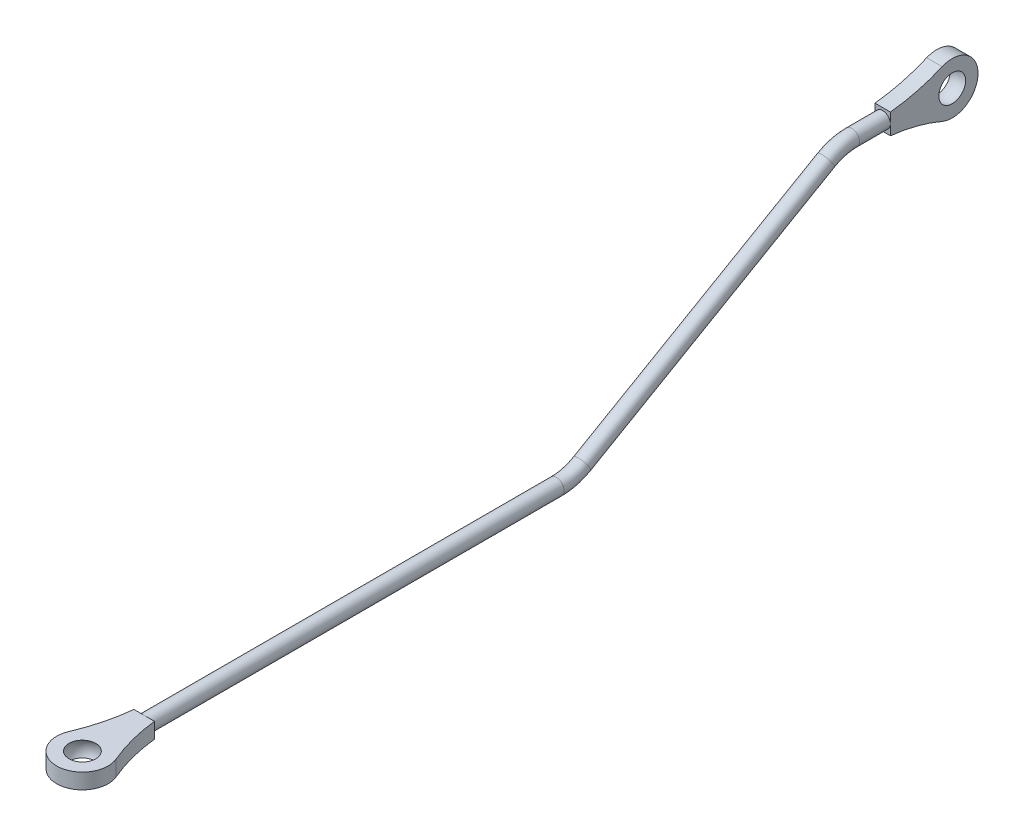
ISO-10303-21;
HEADER;
FILE_DESCRIPTION(('STEP AP214'),'2;1');
FILE_NAME('part.step','',(''),(''),'','','');
FILE_SCHEMA(('AUTOMOTIVE_DESIGN { 1 0 10303 214 1 1 1 1 }'));
ENDSEC;
DATA;
#1=APPLICATION_CONTEXT('core data for automotive mechanical design processes');
#2=APPLICATION_PROTOCOL_DEFINITION('international standard','automotive_design',2000,#1);
#3=PRODUCT_CONTEXT('',#1,'mechanical');
#4=PRODUCT('Part','Part','',(#3));
#5=PRODUCT_RELATED_PRODUCT_CATEGORY('part','',(#4));
#6=PRODUCT_DEFINITION_FORMATION('','',#4);
#7=PRODUCT_DEFINITION_CONTEXT('part definition',#1,'design');
#8=PRODUCT_DEFINITION('design','',#6,#7);
#9=PRODUCT_DEFINITION_SHAPE('','',#8);
#10=(LENGTH_UNIT() NAMED_UNIT(*) SI_UNIT(.MILLI.,.METRE.));
#11=(NAMED_UNIT(*) PLANE_ANGLE_UNIT() SI_UNIT($,.RADIAN.));
#12=(NAMED_UNIT(*) SI_UNIT($,.STERADIAN.) SOLID_ANGLE_UNIT());
#13=UNCERTAINTY_MEASURE_WITH_UNIT(LENGTH_MEASURE(1.E-05),#10,'distance_accuracy_value','');
#14=(GEOMETRIC_REPRESENTATION_CONTEXT(3) GLOBAL_UNCERTAINTY_ASSIGNED_CONTEXT((#13)) GLOBAL_UNIT_ASSIGNED_CONTEXT((#10,
#11,#12)) REPRESENTATION_CONTEXT('',''));
#15=CARTESIAN_POINT('',(0.,0.,0.));
#16=DIRECTION('',(0.,0.,1.));
#17=DIRECTION('',(1.,0.,0.));
#18=AXIS2_PLACEMENT_3D('',#15,#16,#17);
#19=CARTESIAN_POINT('',(31.,-30.,202.320508075689));
#20=DIRECTION('',(-1.,0.,0.));
#21=DIRECTION('',(0.,0.,1.));
#22=AXIS2_PLACEMENT_3D('',#19,#20,#21);
#23=SPHERICAL_SURFACE('',#22,3.);
#24=CARTESIAN_POINT('',(31.,-30.,202.320508075689));
#25=DIRECTION('',(0.,-1.,0.));
#26=DIRECTION('',(0.,0.,-1.));
#27=AXIS2_PLACEMENT_3D('',#24,#25,#26);
#28=SPHERICAL_SURFACE('',#27,3.);
#29=CARTESIAN_POINT('',(31.,-28.5,202.320508075689));
#30=DIRECTION('',(0.,-1.,0.));
#31=DIRECTION('',(0.,0.,-1.));
#32=AXIS2_PLACEMENT_3D('',#29,#30,#31);
#33=CIRCLE('',#32,2.59807621135332);
#34=CARTESIAN_POINT('',(31.,-28.5,199.722431864335));
#35=VERTEX_POINT('',#34);
#36=EDGE_CURVE('E224',#35,#35,#33,.T.);
#37=ORIENTED_EDGE('',*,*,#36,.F.);
#38=EDGE_LOOP('',(#37));
#39=FACE_BOUND('',#38,.T.);
#40=CARTESIAN_POINT('',(31.,-31.5,202.320508075689));
#41=DIRECTION('',(0.,-1.,0.));
#42=DIRECTION('',(0.,0.,-1.));
#43=AXIS2_PLACEMENT_3D('',#40,#41,#42);
#44=CIRCLE('',#43,2.59807621135332);
#45=CARTESIAN_POINT('',(31.,-31.5,199.722431864335));
#46=VERTEX_POINT('',#45);
#47=EDGE_CURVE('E44',#46,#46,#44,.T.);
#48=ORIENTED_EDGE('',*,*,#47,.T.);
#49=EDGE_LOOP('',(#48));
#50=FACE_BOUND('',#49,.T.);
#51=ADVANCED_FACE('F41',(#39,#50),#28,.F.);
#52=CARTESIAN_POINT('',(31.,0.,35.));
#53=DIRECTION('',(0.,0.,1.));
#54=DIRECTION('',(0.,1.,0.));
#55=AXIS2_PLACEMENT_3D('',#52,#53,#54);
#56=SPHERICAL_SURFACE('',#55,3.);
#57=CARTESIAN_POINT('',(31.,0.,35.));
#58=DIRECTION('',(1.,0.,0.));
#59=DIRECTION('',(0.,0.,-1.));
#60=AXIS2_PLACEMENT_3D('',#57,#58,#59);
#61=SPHERICAL_SURFACE('',#60,3.);
#62=CARTESIAN_POINT('',(29.5,0.,35.));
#63=DIRECTION('',(1.,0.,0.));
#64=DIRECTION('',(0.,0.,-1.));
#65=AXIS2_PLACEMENT_3D('',#62,#63,#64);
#66=CIRCLE('',#65,2.59807621135332);
#67=CARTESIAN_POINT('',(29.5,0.,32.4019237886467));
#68=VERTEX_POINT('',#67);
#69=EDGE_CURVE('E138',#68,#68,#66,.T.);
#70=ORIENTED_EDGE('',*,*,#69,.F.);
#71=EDGE_LOOP('',(#70));
#72=FACE_BOUND('',#71,.T.);
#73=CARTESIAN_POINT('',(32.5,0.,35.));
#74=DIRECTION('',(1.,0.,0.));
#75=DIRECTION('',(0.,0.,-1.));
#76=AXIS2_PLACEMENT_3D('',#73,#74,#75);
#77=CIRCLE('',#76,2.59807621135332);
#78=CARTESIAN_POINT('',(32.5,0.,32.4019237886467));
#79=VERTEX_POINT('',#78);
#80=EDGE_CURVE('E221',#79,#79,#77,.T.);
#81=ORIENTED_EDGE('',*,*,#80,.T.);
#82=EDGE_LOOP('',(#81));
#83=FACE_BOUND('',#82,.T.);
#84=ADVANCED_FACE('F243',(#72,#83),#61,.F.);
#85=CARTESIAN_POINT('',(31.,-30.,110.320508075689));
#86=DIRECTION('',(0.,0.,1.));
#87=DIRECTION('',(1.,0.,0.));
#88=AXIS2_PLACEMENT_3D('',#85,#86,#87);
#89=CYLINDRICAL_SURFACE('',#88,1.5);
#90=CARTESIAN_POINT('',(31.,-30.,190.320508075689));
#91=DIRECTION('',(0.,0.,1.));
#92=DIRECTION('',(1.,0.,0.));
#93=AXIS2_PLACEMENT_3D('',#90,#91,#92);
#94=CIRCLE('',#93,1.5);
#95=CARTESIAN_POINT('',(31.,-28.5,190.320508075689));
#96=VERTEX_POINT('',#95);
#97=CARTESIAN_POINT('',(31.,-31.5,190.320508075689));
#98=VERTEX_POINT('',#97);
#99=EDGE_CURVE('E128',#96,#98,#94,.T.);
#100=ORIENTED_EDGE('',*,*,#99,.F.);
#101=EDGE_CURVE('E125',#98,#96,#94,.T.);
#102=ORIENTED_EDGE('',*,*,#101,.F.);
#103=EDGE_LOOP('',(#100,#102));
#104=FACE_BOUND('',#103,.T.);
#105=CARTESIAN_POINT('',(31.,-30.,110.320508075689));
#106=DIRECTION('',(0.,0.,1.));
#107=DIRECTION('',(1.,0.,0.));
#108=AXIS2_PLACEMENT_3D('',#105,#106,#107);
#109=CIRCLE('',#108,1.5);
#110=CARTESIAN_POINT('',(31.,-31.5,110.320508075689));
#111=VERTEX_POINT('',#110);
#112=EDGE_CURVE('E133',#111,#111,#109,.T.);
#113=ORIENTED_EDGE('',*,*,#112,.T.);
#114=EDGE_LOOP('',(#113));
#115=FACE_BOUND('',#114,.T.);
#116=ADVANCED_FACE('F126',(#104,#115),#89,.T.);
#117=CARTESIAN_POINT('',(31.,-20.,110.320508075689));
#118=DIRECTION('',(-1.,0.,0.));
#119=DIRECTION('',(0.,0.,1.));
#120=AXIS2_PLACEMENT_3D('',#117,#118,#119);
#121=TOROIDAL_SURFACE('',#120,10.,1.5);
#122=CARTESIAN_POINT('',(31.,-28.6602540378444,105.320508075689));
#123=DIRECTION('',(0.,-0.500000000000001,0.866025403784438));
#124=DIRECTION('',(1.,0.,0.));
#125=AXIS2_PLACEMENT_3D('',#122,#123,#124);
#126=CIRCLE('',#125,1.5);
#127=CARTESIAN_POINT('',(31.,-29.959292143521,104.570508075689));
#128=VERTEX_POINT('',#127);
#129=EDGE_CURVE('E214',#128,#128,#126,.T.);
#130=CARTESIAN_POINT('',(31.,-20.,110.320508075689));
#131=DIRECTION('',(-1.,0.,0.));
#132=DIRECTION('',(0.,0.,1.));
#133=AXIS2_PLACEMENT_3D('',#130,#131,#132);
#134=CIRCLE('',#133,11.5);
#135=EDGE_CURVE('',#128,#111,#134,.T.);
#136=ORIENTED_EDGE('',*,*,#129,.T.);
#137=ORIENTED_EDGE('',*,*,#112,.F.);
#138=ORIENTED_EDGE('',*,*,#135,.T.);
#139=ORIENTED_EDGE('',*,*,#135,.F.);
#140=EDGE_LOOP('',(#136,#138,#137,#139));
#141=FACE_BOUND('',#140,.T.);
#142=ADVANCED_FACE('F255',(#141),#121,.T.);
#143=CARTESIAN_POINT('',(31.,-1.33974596215562,58.));
#144=DIRECTION('',(0.,-0.500000000000001,0.866025403784438));
#145=DIRECTION('',(0.,-0.866025403784438,-0.500000000000001));
#146=AXIS2_PLACEMENT_3D('',#143,#144,#145);
#147=CYLINDRICAL_SURFACE('',#146,1.5);
#148=ORIENTED_EDGE('',*,*,#129,.F.);
#149=EDGE_LOOP('',(#148));
#150=FACE_BOUND('',#149,.T.);
#151=CARTESIAN_POINT('',(31.,-1.33974596215563,58.));
#152=DIRECTION('',(0.,-0.500000000000002,0.866025403784438));
#153=DIRECTION('',(1.,0.,0.));
#154=AXIS2_PLACEMENT_3D('',#151,#152,#153);
#155=CIRCLE('',#154,1.5);
#156=CARTESIAN_POINT('',(31.,-0.0407078564789755,58.75));
#157=VERTEX_POINT('',#156);
#158=EDGE_CURVE('E211',#157,#157,#155,.T.);
#159=ORIENTED_EDGE('',*,*,#158,.T.);
#160=EDGE_LOOP('',(#159));
#161=FACE_BOUND('',#160,.T.);
#162=ADVANCED_FACE('F262',(#150,#161),#147,.T.);
#163=CARTESIAN_POINT('',(31.,-10.,53.));
#164=DIRECTION('',(1.,0.,0.));
#165=DIRECTION('',(0.,0.,-1.));
#166=AXIS2_PLACEMENT_3D('',#163,#164,#165);
#167=TOROIDAL_SURFACE('',#166,10.,1.5);
#168=CARTESIAN_POINT('',(31.,0.,53.));
#169=DIRECTION('',(0.,0.,1.));
#170=DIRECTION('',(1.,0.,0.));
#171=AXIS2_PLACEMENT_3D('',#168,#169,#170);
#172=CIRCLE('',#171,1.5);
#173=CARTESIAN_POINT('',(31.,1.49999999999999,53.));
#174=VERTEX_POINT('',#173);
#175=EDGE_CURVE('E208',#174,#174,#172,.T.);
#176=CARTESIAN_POINT('',(31.,-10.,53.));
#177=DIRECTION('',(1.,0.,0.));
#178=DIRECTION('',(0.,0.,-1.));
#179=AXIS2_PLACEMENT_3D('',#176,#177,#178);
#180=CIRCLE('',#179,11.5);
#181=EDGE_CURVE('',#174,#157,#180,.T.);
#182=ORIENTED_EDGE('',*,*,#175,.T.);
#183=ORIENTED_EDGE('',*,*,#158,.F.);
#184=ORIENTED_EDGE('',*,*,#181,.T.);
#185=ORIENTED_EDGE('',*,*,#181,.F.);
#186=EDGE_LOOP('',(#182,#184,#183,#185));
#187=FACE_BOUND('',#186,.T.);
#188=ADVANCED_FACE('F266',(#187),#167,.T.);
#189=CARTESIAN_POINT('',(31.,0.,47.));
#190=DIRECTION('',(0.,0.,1.));
#191=DIRECTION('',(0.,-1.,0.));
#192=AXIS2_PLACEMENT_3D('',#189,#190,#191);
#193=CYLINDRICAL_SURFACE('',#192,1.5);
#194=ORIENTED_EDGE('',*,*,#175,.F.);
#195=EDGE_LOOP('',(#194));
#196=FACE_BOUND('',#195,.T.);
#197=CARTESIAN_POINT('',(31.,0.,47.));
#198=DIRECTION('',(0.,0.,1.));
#199=DIRECTION('',(1.,0.,0.));
#200=AXIS2_PLACEMENT_3D('',#197,#198,#199);
#201=CIRCLE('',#200,1.5);
#202=CARTESIAN_POINT('',(32.5,0.,47.));
#203=VERTEX_POINT('',#202);
#204=CARTESIAN_POINT('',(29.5,0.,47.));
#205=VERTEX_POINT('',#204);
#206=EDGE_CURVE('E205',#203,#205,#201,.T.);
#207=ORIENTED_EDGE('',*,*,#206,.T.);
#208=EDGE_CURVE('E204',#205,#203,#201,.T.);
#209=ORIENTED_EDGE('',*,*,#208,.T.);
#210=EDGE_LOOP('',(#207,#209));
#211=FACE_BOUND('',#210,.T.);
#212=ADVANCED_FACE('F270',(#196,#211),#193,.T.);
#213=CARTESIAN_POINT('',(32.5,36.8187330461759,50.6595963097381));
#214=DIRECTION('',(-1.,0.,0.));
#215=DIRECTION('',(0.,0.,1.));
#216=AXIS2_PLACEMENT_3D('',#213,#214,#215);
#217=CYLINDRICAL_SURFACE('',#216,35.0105243618417);
#218=CARTESIAN_POINT('',(29.5,36.8187330461759,50.6595963097381));
#219=DIRECTION('',(-1.,0.,0.));
#220=DIRECTION('',(0.,0.,-1.));
#221=AXIS2_PLACEMENT_3D('',#218,#219,#220);
#222=CIRCLE('',#221,35.0105243618417);
#223=CARTESIAN_POINT('',(29.5,4.60113103157556,36.956934651508));
#224=VERTEX_POINT('',#223);
#225=CARTESIAN_POINT('',(29.5,2.,47.));
#226=VERTEX_POINT('',#225);
#227=EDGE_CURVE('E172',#224,#226,#222,.T.);
#228=ORIENTED_EDGE('',*,*,#227,.T.);
#229=DIRECTION('',(-1.,0.,0.));
#230=VECTOR('',#229,1.);
#231=CARTESIAN_POINT('',(32.5,2.,47.));
#232=LINE('',#231,#230);
#233=CARTESIAN_POINT('',(32.5,2.,47.));
#234=VERTEX_POINT('',#233);
#235=EDGE_CURVE('E198',#234,#226,#232,.T.);
#236=ORIENTED_EDGE('',*,*,#235,.F.);
#237=CARTESIAN_POINT('',(32.5,36.8187330461759,50.6595963097381));
#238=DIRECTION('',(-1.,0.,0.));
#239=DIRECTION('',(0.,0.,-1.));
#240=AXIS2_PLACEMENT_3D('',#237,#238,#239);
#241=CIRCLE('',#240,35.0105243618417);
#242=CARTESIAN_POINT('',(32.5,4.60113103157556,36.956934651508));
#243=VERTEX_POINT('',#242);
#244=EDGE_CURVE('E179',#243,#234,#241,.T.);
#245=ORIENTED_EDGE('',*,*,#244,.F.);
#246=DIRECTION('',(-1.,0.,0.));
#247=VECTOR('',#246,1.);
#248=CARTESIAN_POINT('',(32.5,4.60113103157556,36.956934651508));
#249=LINE('',#248,#247);
#250=EDGE_CURVE('E201',#243,#224,#249,.T.);
#251=ORIENTED_EDGE('',*,*,#250,.T.);
#252=EDGE_LOOP('',(#228,#236,#245,#251));
#253=FACE_BOUND('',#252,.T.);
#254=ADVANCED_FACE('F274',(#253),#217,.F.);
#255=CARTESIAN_POINT('',(32.5,2.,47.));
#256=DIRECTION('',(0.,0.,-1.));
#257=DIRECTION('',(-1.,0.,0.));
#258=AXIS2_PLACEMENT_3D('',#255,#256,#257);
#259=PLANE('',#258);
#260=ORIENTED_EDGE('',*,*,#206,.F.);
#261=DIRECTION('',(0.,-1.,0.));
#262=VECTOR('',#261,1.);
#263=CARTESIAN_POINT('',(32.5,2.,47.));
#264=LINE('',#263,#262);
#265=EDGE_CURVE('E182',#234,#203,#264,.T.);
#266=ORIENTED_EDGE('',*,*,#265,.F.);
#267=ORIENTED_EDGE('',*,*,#235,.T.);
#268=DIRECTION('',(0.,-1.,0.));
#269=VECTOR('',#268,1.);
#270=CARTESIAN_POINT('',(29.5,2.,47.));
#271=LINE('',#270,#269);
#272=EDGE_CURVE('E189',#226,#205,#271,.T.);
#273=ORIENTED_EDGE('',*,*,#272,.T.);
#274=EDGE_LOOP('',(#260,#266,#267,#273));
#275=FACE_BOUND('',#274,.T.);
#276=ADVANCED_FACE('F284',(#275),#259,.F.);
#277=ORIENTED_EDGE('',*,*,#208,.F.);
#278=CARTESIAN_POINT('',(29.5,-2.00000000000001,47.));
#279=VERTEX_POINT('',#278);
#280=EDGE_CURVE('E188',#205,#279,#271,.T.);
#281=ORIENTED_EDGE('',*,*,#280,.T.);
#282=DIRECTION('',(-1.,0.,0.));
#283=VECTOR('',#282,1.);
#284=CARTESIAN_POINT('',(32.5,-2.00000000000001,47.));
#285=LINE('',#284,#283);
#286=CARTESIAN_POINT('',(32.5,-2.00000000000001,47.));
#287=VERTEX_POINT('',#286);
#288=EDGE_CURVE('E195',#287,#279,#285,.T.);
#289=ORIENTED_EDGE('',*,*,#288,.F.);
#290=EDGE_CURVE('E181',#203,#287,#264,.T.);
#291=ORIENTED_EDGE('',*,*,#290,.F.);
#292=EDGE_LOOP('',(#277,#281,#289,#291));
#293=FACE_BOUND('',#292,.T.);
#294=ADVANCED_FACE('F286',(#293),#259,.F.);
#295=CARTESIAN_POINT('',(32.5,-36.8187330461759,50.6595963097381));
#296=DIRECTION('',(-1.,0.,0.));
#297=DIRECTION('',(0.,0.,1.));
#298=AXIS2_PLACEMENT_3D('',#295,#296,#297);
#299=CYLINDRICAL_SURFACE('',#298,35.0105243618417);
#300=CARTESIAN_POINT('',(29.5,-36.8187330461759,50.6595963097381));
#301=DIRECTION('',(-1.,0.,0.));
#302=DIRECTION('',(0.,0.,1.));
#303=AXIS2_PLACEMENT_3D('',#300,#301,#302);
#304=CIRCLE('',#303,35.0105243618417);
#305=CARTESIAN_POINT('',(29.5,-4.60113103157556,36.9569346515079));
#306=VERTEX_POINT('',#305);
#307=EDGE_CURVE('E178',#279,#306,#304,.T.);
#308=ORIENTED_EDGE('',*,*,#307,.T.);
#309=DIRECTION('',(-1.,0.,0.));
#310=VECTOR('',#309,1.);
#311=CARTESIAN_POINT('',(32.5,-4.60113103157556,36.9569346515079));
#312=LINE('',#311,#310);
#313=CARTESIAN_POINT('',(32.5,-4.60113103157556,36.9569346515079));
#314=VERTEX_POINT('',#313);
#315=EDGE_CURVE('E185',#314,#306,#312,.T.);
#316=ORIENTED_EDGE('',*,*,#315,.F.);
#317=CARTESIAN_POINT('',(32.5,-36.8187330461759,50.6595963097381));
#318=DIRECTION('',(-1.,0.,0.));
#319=DIRECTION('',(0.,0.,1.));
#320=AXIS2_PLACEMENT_3D('',#317,#318,#319);
#321=CIRCLE('',#320,35.0105243618417);
#322=EDGE_CURVE('E184',#287,#314,#321,.T.);
#323=ORIENTED_EDGE('',*,*,#322,.F.);
#324=ORIENTED_EDGE('',*,*,#288,.T.);
#325=EDGE_LOOP('',(#308,#316,#323,#324));
#326=FACE_BOUND('',#325,.T.);
#327=ADVANCED_FACE('F280',(#326),#299,.F.);
#328=CARTESIAN_POINT('',(32.5,0.,35.));
#329=DIRECTION('',(-1.,0.,0.));
#330=DIRECTION('',(0.,0.,1.));
#331=AXIS2_PLACEMENT_3D('',#328,#329,#330);
#332=CYLINDRICAL_SURFACE('',#331,5.00000000000001);
#333=CARTESIAN_POINT('',(29.5,0.,35.));
#334=DIRECTION('',(1.,0.,0.));
#335=DIRECTION('',(0.,0.,-1.));
#336=AXIS2_PLACEMENT_3D('',#333,#334,#335);
#337=CIRCLE('',#336,5.00000000000001);
#338=EDGE_CURVE('E167',#306,#224,#337,.T.);
#339=ORIENTED_EDGE('',*,*,#338,.T.);
#340=ORIENTED_EDGE('',*,*,#250,.F.);
#341=CARTESIAN_POINT('',(32.5,0.,35.));
#342=DIRECTION('',(1.,0.,0.));
#343=DIRECTION('',(0.,0.,-1.));
#344=AXIS2_PLACEMENT_3D('',#341,#342,#343);
#345=CIRCLE('',#344,5.00000000000001);
#346=EDGE_CURVE('E175',#314,#243,#345,.T.);
#347=ORIENTED_EDGE('',*,*,#346,.F.);
#348=ORIENTED_EDGE('',*,*,#315,.T.);
#349=EDGE_LOOP('',(#339,#340,#347,#348));
#350=FACE_BOUND('',#349,.T.);
#351=ADVANCED_FACE('F276',(#350),#332,.T.);
#352=CARTESIAN_POINT('',(29.5,0.,35.));
#353=DIRECTION('',(1.,0.,0.));
#354=DIRECTION('',(0.,0.,-1.));
#355=AXIS2_PLACEMENT_3D('',#352,#353,#354);
#356=PLANE('',#355);
#357=ORIENTED_EDGE('',*,*,#69,.T.);
#358=EDGE_LOOP('',(#357));
#359=FACE_BOUND('',#358,.T.);
#360=ORIENTED_EDGE('',*,*,#338,.F.);
#361=ORIENTED_EDGE('',*,*,#307,.F.);
#362=ORIENTED_EDGE('',*,*,#280,.F.);
#363=ORIENTED_EDGE('',*,*,#272,.F.);
#364=ORIENTED_EDGE('',*,*,#227,.F.);
#365=EDGE_LOOP('',(#360,#361,#362,#363,#364));
#366=FACE_BOUND('',#365,.T.);
#367=ADVANCED_FACE('F279',(#359,#366),#356,.F.);
#368=CARTESIAN_POINT('',(32.5,0.,35.));
#369=DIRECTION('',(1.,0.,0.));
#370=DIRECTION('',(0.,0.,-1.));
#371=AXIS2_PLACEMENT_3D('',#368,#369,#370);
#372=PLANE('',#371);
#373=ORIENTED_EDGE('',*,*,#80,.F.);
#374=EDGE_LOOP('',(#373));
#375=FACE_BOUND('',#374,.T.);
#376=ORIENTED_EDGE('',*,*,#346,.T.);
#377=ORIENTED_EDGE('',*,*,#244,.T.);
#378=ORIENTED_EDGE('',*,*,#265,.T.);
#379=ORIENTED_EDGE('',*,*,#290,.T.);
#380=ORIENTED_EDGE('',*,*,#322,.T.);
#381=EDGE_LOOP('',(#376,#377,#378,#379,#380));
#382=FACE_BOUND('',#381,.T.);
#383=ADVANCED_FACE('F295',(#375,#382),#372,.T.);
#384=CARTESIAN_POINT('',(29.,-28.5,190.320508075689));
#385=DIRECTION('',(0.,0.,1.));
#386=DIRECTION('',(1.,0.,0.));
#387=AXIS2_PLACEMENT_3D('',#384,#385,#386);
#388=PLANE('',#387);
#389=DIRECTION('',(-1.,0.,0.));
#390=VECTOR('',#389,1.);
#391=CARTESIAN_POINT('',(29.,-28.5,190.320508075689));
#392=LINE('',#391,#390);
#393=CARTESIAN_POINT('',(29.,-28.5,190.320508075689));
#394=VERTEX_POINT('',#393);
#395=EDGE_CURVE('E136',#96,#394,#392,.T.);
#396=ORIENTED_EDGE('',*,*,#395,.F.);
#397=ORIENTED_EDGE('',*,*,#99,.T.);
#398=DIRECTION('',(-1.,0.,0.));
#399=VECTOR('',#398,1.);
#400=CARTESIAN_POINT('',(29.,-31.5,190.320508075689));
#401=LINE('',#400,#399);
#402=CARTESIAN_POINT('',(29.,-31.5,190.320508075689));
#403=VERTEX_POINT('',#402);
#404=EDGE_CURVE('E85',#98,#403,#401,.T.);
#405=ORIENTED_EDGE('',*,*,#404,.T.);
#406=DIRECTION('',(0.,-1.,0.));
#407=VECTOR('',#406,1.);
#408=CARTESIAN_POINT('',(29.,-28.5,190.320508075689));
#409=LINE('',#408,#407);
#410=EDGE_CURVE('E151',#394,#403,#409,.T.);
#411=ORIENTED_EDGE('',*,*,#410,.F.);
#412=EDGE_LOOP('',(#396,#397,#405,#411));
#413=FACE_BOUND('',#412,.T.);
#414=ADVANCED_FACE('F135',(#413),#388,.F.);
#415=CARTESIAN_POINT('',(33.,-31.5,190.320508075689));
#416=VERTEX_POINT('',#415);
#417=EDGE_CURVE('E141',#416,#98,#401,.T.);
#418=ORIENTED_EDGE('',*,*,#417,.T.);
#419=ORIENTED_EDGE('',*,*,#101,.T.);
#420=CARTESIAN_POINT('',(33.,-28.5,190.320508075689));
#421=VERTEX_POINT('',#420);
#422=EDGE_CURVE('E155',#421,#96,#392,.T.);
#423=ORIENTED_EDGE('',*,*,#422,.F.);
#424=DIRECTION('',(0.,-1.,0.));
#425=VECTOR('',#424,1.);
#426=CARTESIAN_POINT('',(33.,-28.5,190.320508075689));
#427=LINE('',#426,#425);
#428=EDGE_CURVE('E147',#421,#416,#427,.T.);
#429=ORIENTED_EDGE('',*,*,#428,.T.);
#430=EDGE_LOOP('',(#418,#419,#423,#429));
#431=FACE_BOUND('',#430,.T.);
#432=ADVANCED_FACE('F145',(#431),#388,.F.);
#433=CARTESIAN_POINT('',(-5.81873304617761,-28.5,186.66091176595));
#434=DIRECTION('',(0.,-1.,0.));
#435=DIRECTION('',(0.,0.,-1.));
#436=AXIS2_PLACEMENT_3D('',#433,#434,#435);
#437=PLANE('',#436);
#438=ORIENTED_EDGE('',*,*,#36,.T.);
#439=EDGE_LOOP('',(#438));
#440=FACE_BOUND('',#439,.T.);
#441=CARTESIAN_POINT('',(-5.81873304617761,-28.5,186.66091176595));
#442=DIRECTION('',(0.,-1.,0.));
#443=DIRECTION('',(0.,0.,-1.));
#444=AXIS2_PLACEMENT_3D('',#441,#442,#443);
#445=CIRCLE('',#444,35.0105243618434);
#446=CARTESIAN_POINT('',(26.3988689684244,-28.5,200.363573424181));
#447=VERTEX_POINT('',#446);
#448=EDGE_CURVE('E148',#394,#447,#445,.T.);
#449=ORIENTED_EDGE('',*,*,#448,.T.);
#450=CARTESIAN_POINT('',(31.,-28.5,202.320508075689));
#451=DIRECTION('',(0.,1.,0.));
#452=DIRECTION('',(0.,0.,-1.));
#453=AXIS2_PLACEMENT_3D('',#450,#451,#452);
#454=CIRCLE('',#453,4.99999999999998);
#455=CARTESIAN_POINT('',(35.6011310315756,-28.5,200.363573424181));
#456=VERTEX_POINT('',#455);
#457=EDGE_CURVE('E75',#447,#456,#454,.T.);
#458=ORIENTED_EDGE('',*,*,#457,.T.);
#459=CARTESIAN_POINT('',(67.8187330461776,-28.5,186.66091176595));
#460=DIRECTION('',(0.,-1.,0.));
#461=DIRECTION('',(0.,0.,1.));
#462=AXIS2_PLACEMENT_3D('',#459,#460,#461);
#463=CIRCLE('',#462,35.0105243618434);
#464=EDGE_CURVE('E157',#456,#421,#463,.T.);
#465=ORIENTED_EDGE('',*,*,#464,.T.);
#466=ORIENTED_EDGE('',*,*,#422,.T.);
#467=ORIENTED_EDGE('',*,*,#395,.T.);
#468=EDGE_LOOP('',(#449,#458,#465,#466,#467));
#469=FACE_BOUND('',#468,.T.);
#470=ADVANCED_FACE('F160',(#440,#469),#437,.F.);
#471=CARTESIAN_POINT('',(-5.81873304617761,-31.5,186.66091176595));
#472=DIRECTION('',(0.,-1.,0.));
#473=DIRECTION('',(0.,0.,-1.));
#474=AXIS2_PLACEMENT_3D('',#471,#472,#473);
#475=PLANE('',#474);
#476=ORIENTED_EDGE('',*,*,#47,.F.);
#477=EDGE_LOOP('',(#476));
#478=FACE_BOUND('',#477,.T.);
#479=CARTESIAN_POINT('',(-5.81873304617761,-31.5,186.66091176595));
#480=DIRECTION('',(0.,-1.,0.));
#481=DIRECTION('',(0.,0.,-1.));
#482=AXIS2_PLACEMENT_3D('',#479,#480,#481);
#483=CIRCLE('',#482,35.0105243618434);
#484=CARTESIAN_POINT('',(26.3988689684244,-31.5,200.363573424181));
#485=VERTEX_POINT('',#484);
#486=EDGE_CURVE('E11',#403,#485,#483,.T.);
#487=ORIENTED_EDGE('',*,*,#486,.F.);
#488=ORIENTED_EDGE('',*,*,#404,.F.);
#489=ORIENTED_EDGE('',*,*,#417,.F.);
#490=CARTESIAN_POINT('',(67.8187330461776,-31.5,186.66091176595));
#491=DIRECTION('',(0.,-1.,0.));
#492=DIRECTION('',(0.,0.,1.));
#493=AXIS2_PLACEMENT_3D('',#490,#491,#492);
#494=CIRCLE('',#493,35.0105243618434);
#495=CARTESIAN_POINT('',(35.6011310315756,-31.5,200.363573424181));
#496=VERTEX_POINT('',#495);
#497=EDGE_CURVE('E142',#496,#416,#494,.T.);
#498=ORIENTED_EDGE('',*,*,#497,.F.);
#499=CARTESIAN_POINT('',(31.,-31.5,202.320508075689));
#500=DIRECTION('',(0.,1.,0.));
#501=DIRECTION('',(0.,0.,-1.));
#502=AXIS2_PLACEMENT_3D('',#499,#500,#501);
#503=CIRCLE('',#502,4.99999999999998);
#504=EDGE_CURVE('E50',#485,#496,#503,.T.);
#505=ORIENTED_EDGE('',*,*,#504,.F.);
#506=EDGE_LOOP('',(#487,#488,#489,#498,#505));
#507=FACE_BOUND('',#506,.T.);
#508=ADVANCED_FACE('F140',(#478,#507),#475,.T.);
#509=CARTESIAN_POINT('',(-5.81873304617761,-28.5,186.66091176595));
#510=DIRECTION('',(0.,-1.,0.));
#511=DIRECTION('',(0.,0.,-1.));
#512=AXIS2_PLACEMENT_3D('',#509,#510,#511);
#513=CYLINDRICAL_SURFACE('',#512,35.0105243618434);
#514=ORIENTED_EDGE('',*,*,#486,.T.);
#515=DIRECTION('',(0.,-1.,0.));
#516=VECTOR('',#515,1.);
#517=CARTESIAN_POINT('',(26.3988689684244,-28.5,200.363573424181));
#518=LINE('',#517,#516);
#519=EDGE_CURVE('E165',#447,#485,#518,.T.);
#520=ORIENTED_EDGE('',*,*,#519,.F.);
#521=ORIENTED_EDGE('',*,*,#448,.F.);
#522=ORIENTED_EDGE('',*,*,#410,.T.);
#523=EDGE_LOOP('',(#514,#520,#521,#522));
#524=FACE_BOUND('',#523,.T.);
#525=ADVANCED_FACE('F164',(#524),#513,.F.);
#526=CARTESIAN_POINT('',(31.,-28.5,202.320508075689));
#527=DIRECTION('',(0.,-1.,0.));
#528=DIRECTION('',(0.,0.,-1.));
#529=AXIS2_PLACEMENT_3D('',#526,#527,#528);
#530=CYLINDRICAL_SURFACE('',#529,4.99999999999998);
#531=ORIENTED_EDGE('',*,*,#504,.T.);
#532=DIRECTION('',(0.,-1.,0.));
#533=VECTOR('',#532,1.);
#534=CARTESIAN_POINT('',(35.6011310315756,-28.5,200.363573424181));
#535=LINE('',#534,#533);
#536=EDGE_CURVE('E166',#456,#496,#535,.T.);
#537=ORIENTED_EDGE('',*,*,#536,.F.);
#538=ORIENTED_EDGE('',*,*,#457,.F.);
#539=ORIENTED_EDGE('',*,*,#519,.T.);
#540=EDGE_LOOP('',(#531,#537,#538,#539));
#541=FACE_BOUND('',#540,.T.);
#542=ADVANCED_FACE('F239',(#541),#530,.T.);
#543=CARTESIAN_POINT('',(67.8187330461776,-28.5,186.66091176595));
#544=DIRECTION('',(0.,-1.,0.));
#545=DIRECTION('',(0.,0.,-1.));
#546=AXIS2_PLACEMENT_3D('',#543,#544,#545);
#547=CYLINDRICAL_SURFACE('',#546,35.0105243618434);
#548=ORIENTED_EDGE('',*,*,#497,.T.);
#549=ORIENTED_EDGE('',*,*,#428,.F.);
#550=ORIENTED_EDGE('',*,*,#464,.F.);
#551=ORIENTED_EDGE('',*,*,#536,.T.);
#552=EDGE_LOOP('',(#548,#549,#550,#551));
#553=FACE_BOUND('',#552,.T.);
#554=ADVANCED_FACE('F302',(#553),#547,.F.);
#555=CLOSED_SHELL('',(#51,#84,#116,#142,#162,#188,#212,#254,#276,#294,#327,#351,#367,#383,#414,
#432,#470,#508,#525,#542,#554));
#556=MANIFOLD_SOLID_BREP('B2',#555);
#557=ADVANCED_BREP_SHAPE_REPRESENTATION('',(#18,#556),#14);
#558=SHAPE_DEFINITION_REPRESENTATION(#9,#557);
ENDSEC;
END-ISO-10303-21;
